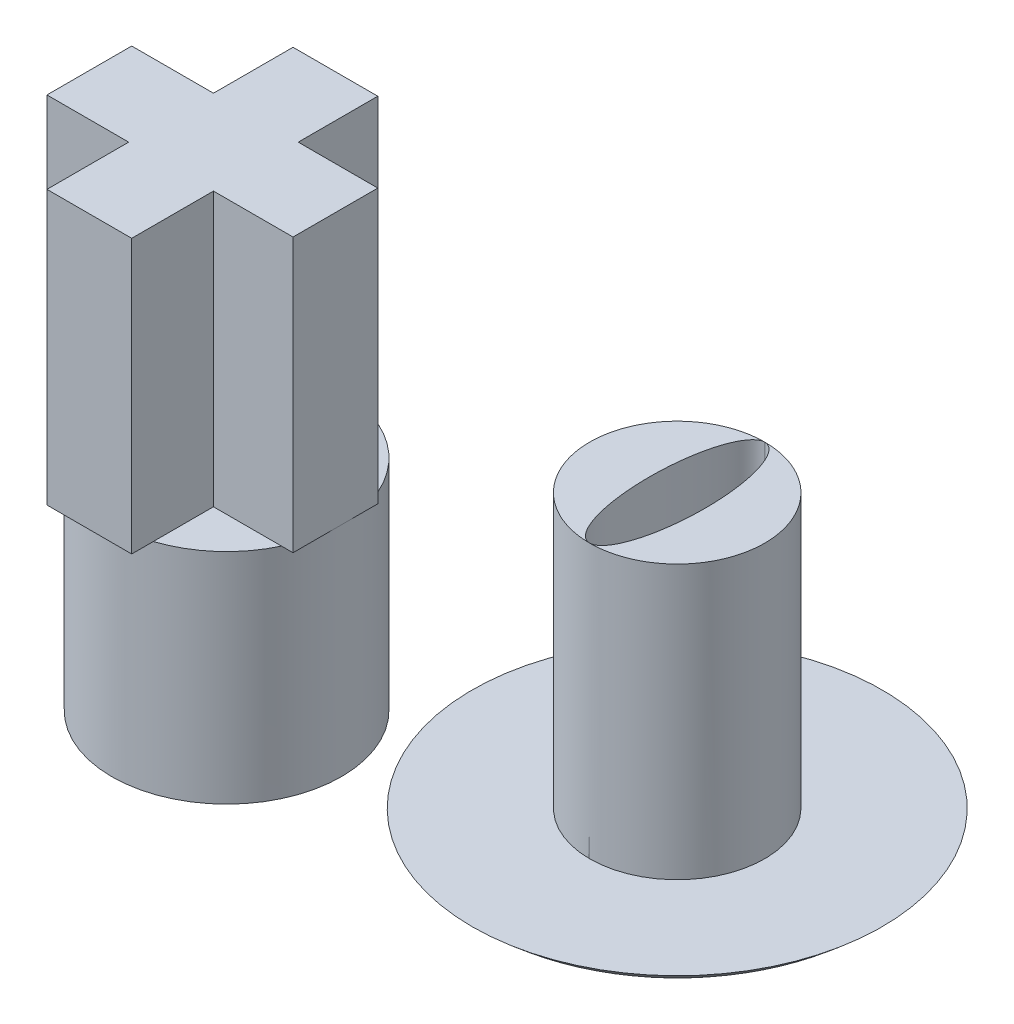
ISO-10303-21;
HEADER;
FILE_DESCRIPTION(('STEP AP214'),'2;1');
FILE_NAME('part.step','',(''),(''),'','','');
FILE_SCHEMA(('AUTOMOTIVE_DESIGN { 1 0 10303 214 1 1 1 1 }'));
ENDSEC;
DATA;
#1=APPLICATION_CONTEXT('core data for automotive mechanical design processes');
#2=APPLICATION_PROTOCOL_DEFINITION('international standard','automotive_design',2000,#1);
#3=PRODUCT_CONTEXT('',#1,'mechanical');
#4=PRODUCT('Part','Part','',(#3));
#5=PRODUCT_RELATED_PRODUCT_CATEGORY('part','',(#4));
#6=PRODUCT_DEFINITION_FORMATION('','',#4);
#7=PRODUCT_DEFINITION_CONTEXT('part definition',#1,'design');
#8=PRODUCT_DEFINITION('design','',#6,#7);
#9=PRODUCT_DEFINITION_SHAPE('','',#8);
#10=(LENGTH_UNIT() NAMED_UNIT(*) SI_UNIT(.MILLI.,.METRE.));
#11=(NAMED_UNIT(*) PLANE_ANGLE_UNIT() SI_UNIT($,.RADIAN.));
#12=(NAMED_UNIT(*) SI_UNIT($,.STERADIAN.) SOLID_ANGLE_UNIT());
#13=UNCERTAINTY_MEASURE_WITH_UNIT(LENGTH_MEASURE(1.E-05),#10,'distance_accuracy_value','');
#14=(GEOMETRIC_REPRESENTATION_CONTEXT(3) GLOBAL_UNCERTAINTY_ASSIGNED_CONTEXT((#13)) GLOBAL_UNIT_ASSIGNED_CONTEXT((#10,
#11,#12)) REPRESENTATION_CONTEXT('',''));
#15=CARTESIAN_POINT('',(0.,0.,0.));
#16=DIRECTION('',(0.,0.,1.));
#17=DIRECTION('',(1.,0.,0.));
#18=AXIS2_PLACEMENT_3D('',#15,#16,#17);
#19=CARTESIAN_POINT('',(6.68090224938002,1.01039824502667,-1.55928841292375));
#20=DIRECTION('',(0.,1.,0.));
#21=DIRECTION('',(0.,0.,1.));
#22=AXIS2_PLACEMENT_3D('',#19,#20,#21);
#23=PLANE('',#22);
#24=CARTESIAN_POINT('',(6.68090224938002,1.01039824502667,-1.55928841292375));
#25=DIRECTION('',(0.,1.,0.));
#26=DIRECTION('',(0.,0.,1.));
#27=AXIS2_PLACEMENT_3D('',#24,#25,#26);
#28=CIRCLE('',#27,1.6);
#29=CARTESIAN_POINT('',(6.68090224938002,1.01039824502667,0.0407115870762478));
#30=VERTEX_POINT('',#29);
#31=EDGE_CURVE('P0_E29',#30,#30,#28,.T.);
#32=ORIENTED_EDGE('',*,*,#31,.F.);
#33=EDGE_LOOP('',(#32));
#34=FACE_BOUND('',#33,.T.);
#35=CARTESIAN_POINT('',(6.68090224938002,1.01039824502667,-1.55928841292375));
#36=DIRECTION('',(0.,1.,0.));
#37=DIRECTION('',(0.,0.,1.));
#38=AXIS2_PLACEMENT_3D('',#35,#36,#37);
#39=CIRCLE('',#38,3.75);
#40=CARTESIAN_POINT('',(6.68090224938002,1.01039824502667,2.19071158707625));
#41=VERTEX_POINT('',#40);
#42=EDGE_CURVE('P0_E21',#41,#41,#39,.T.);
#43=ORIENTED_EDGE('',*,*,#42,.T.);
#44=EDGE_LOOP('',(#43));
#45=FACE_BOUND('',#44,.T.);
#46=ADVANCED_FACE('P0_F14',(#34,#45),#23,.T.);
#47=CARTESIAN_POINT('',(6.68090224938002,0.0103982450266698,-1.55928841292375));
#48=DIRECTION('',(0.,1.,0.));
#49=DIRECTION('',(0.,0.,1.));
#50=AXIS2_PLACEMENT_3D('',#47,#48,#49);
#51=PLANE('',#50);
#52=CARTESIAN_POINT('',(6.68090224938002,0.0103982450266698,-1.55928841292375));
#53=DIRECTION('',(0.,1.,0.));
#54=DIRECTION('',(0.,0.,1.));
#55=AXIS2_PLACEMENT_3D('',#52,#53,#54);
#56=CIRCLE('',#55,1.20049024320361);
#57=CARTESIAN_POINT('',(6.68090224938002,0.0103982450266698,-0.358798169720145));
#58=VERTEX_POINT('',#57);
#59=EDGE_CURVE('P0_E9',#58,#58,#56,.F.);
#60=ORIENTED_EDGE('',*,*,#59,.T.);
#61=EDGE_LOOP('',(#60));
#62=FACE_BOUND('',#61,.T.);
#63=ADVANCED_FACE('P0_F56',(#62),#51,.F.);
#64=CARTESIAN_POINT('',(6.68090224938002,3.76039824502667,-1.55928841292375));
#65=DIRECTION('',(0.,-1.,0.));
#66=DIRECTION('',(0.,0.,-1.));
#67=AXIS2_PLACEMENT_3D('',#64,#65,#66);
#68=DEGENERATE_TOROIDAL_SURFACE('',#67,1.20049024320361,3.75,.T.);
#69=ORIENTED_EDGE('',*,*,#59,.F.);
#70=EDGE_LOOP('',(#69));
#71=FACE_BOUND('',#70,.T.);
#72=ORIENTED_EDGE('',*,*,#42,.F.);
#73=EDGE_LOOP('',(#72));
#74=FACE_BOUND('',#73,.T.);
#75=ADVANCED_FACE('P0_F16',(#71,#74),#68,.T.);
#76=CARTESIAN_POINT('',(6.68090224938002,6.01039824502667,-1.55928841292375));
#77=DIRECTION('',(0.,-1.,0.));
#78=DIRECTION('',(0.,0.,-1.));
#79=AXIS2_PLACEMENT_3D('',#76,#77,#78);
#80=CYLINDRICAL_SURFACE('',#79,1.6);
#81=CARTESIAN_POINT('',(6.68090224938002,6.01039824502667,-1.55928841292375));
#82=DIRECTION('',(0.,1.,0.));
#83=DIRECTION('',(0.,0.,1.));
#84=AXIS2_PLACEMENT_3D('',#81,#82,#83);
#85=CIRCLE('',#84,1.6);
#86=CARTESIAN_POINT('',(6.68090224938002,6.01039824502667,0.0407115870762478));
#87=VERTEX_POINT('',#86);
#88=EDGE_CURVE('P0_E25',#87,#87,#85,.T.);
#89=ORIENTED_EDGE('',*,*,#88,.F.);
#90=EDGE_LOOP('',(#89));
#91=FACE_BOUND('',#90,.T.);
#92=ORIENTED_EDGE('',*,*,#31,.T.);
#93=EDGE_LOOP('',(#92));
#94=FACE_BOUND('',#93,.T.);
#95=ADVANCED_FACE('P0_F50',(#91,#94),#80,.T.);
#96=CARTESIAN_POINT('',(6.68090224938002,6.01039824502667,-1.55928841292375));
#97=DIRECTION('',(0.,1.,0.));
#98=DIRECTION('',(0.,0.,1.));
#99=AXIS2_PLACEMENT_3D('',#96,#97,#98);
#100=PLANE('',#99);
#101=CARTESIAN_POINT('',(6.68090224938002,6.01039824502667,-1.55928841292375));
#102=DIRECTION('',(0.,1.,0.));
#103=DIRECTION('',(-0.000982907133391704,0.,0.999999516946667));
#104=AXIS2_PLACEMENT_3D('',#101,#102,#103);
#105=ELLIPSE('',#104,1.59991667513477,0.502892673821975);
#106=CARTESIAN_POINT('',(6.6793296798672,6.01039824502667,0.0406274893659398));
#107=VERTEX_POINT('',#106);
#108=EDGE_CURVE('P0_E35',#107,#107,#105,.T.);
#109=ORIENTED_EDGE('',*,*,#108,.F.);
#110=EDGE_LOOP('',(#109));
#111=FACE_BOUND('',#110,.T.);
#112=ORIENTED_EDGE('',*,*,#88,.T.);
#113=EDGE_LOOP('',(#112));
#114=FACE_BOUND('',#113,.T.);
#115=ADVANCED_FACE('P0_F46',(#111,#114),#100,.T.);
#116=CARTESIAN_POINT('',(6.68090224938002,1.01039824502667,-1.55928841292375));
#117=DIRECTION('',(0.,1.,0.));
#118=DIRECTION('',(-0.000982907133391704,0.,0.999999516946667));
#119=AXIS2_PLACEMENT_3D('',#116,#117,#118);
#120=ELLIPSE('',#119,1.59991667513477,0.502892673821975);
#121=DIRECTION('',(0.,1.,0.));
#122=VECTOR('',#121,1.);
#123=SURFACE_OF_LINEAR_EXTRUSION('',#120,#122);
#124=CARTESIAN_POINT('',(6.6793296798672,1.01039824502667,0.0406274893659398));
#125=VERTEX_POINT('',#124);
#126=EDGE_CURVE('P0_E33',#125,#125,#120,.T.);
#127=ORIENTED_EDGE('',*,*,#126,.F.);
#128=EDGE_LOOP('',(#127));
#129=FACE_BOUND('',#128,.T.);
#130=ORIENTED_EDGE('',*,*,#108,.T.);
#131=EDGE_LOOP('',(#130));
#132=FACE_BOUND('',#131,.T.);
#133=ADVANCED_FACE('P0_F41',(#129,#132),#123,.F.);
#134=CARTESIAN_POINT('',(6.68090224938002,1.01039824502667,-1.55928841292375));
#135=DIRECTION('',(0.,1.,0.));
#136=DIRECTION('',(0.,0.,1.));
#137=AXIS2_PLACEMENT_3D('',#134,#135,#136);
#138=PLANE('',#137);
#139=ORIENTED_EDGE('',*,*,#126,.T.);
#140=EDGE_LOOP('',(#139));
#141=FACE_BOUND('',#140,.T.);
#142=ADVANCED_FACE('P0_F45',(#141),#138,.T.);
#143=CLOSED_SHELL('',(#46,#63,#75,#95,#115,#133,#142));
#144=MANIFOLD_SOLID_BREP('P0_B1',#143);
#145=CARTESIAN_POINT('',(0.,4.,0.));
#146=DIRECTION('',(0.,1.,0.));
#147=DIRECTION('',(0.,0.,1.));
#148=AXIS2_PLACEMENT_3D('',#145,#146,#147);
#149=PLANE('',#148);
#150=DIRECTION('',(0.,0.,-1.));
#151=VECTOR('',#150,1.);
#152=CARTESIAN_POINT('',(0.655,4.,-0.655));
#153=LINE('',#152,#151);
#154=CARTESIAN_POINT('',(0.655,4.,-0.655));
#155=VERTEX_POINT('',#154);
#156=CARTESIAN_POINT('',(0.655,4.,-1.99523808103194));
#157=VERTEX_POINT('',#156);
#158=EDGE_CURVE('P1_E35',#155,#157,#153,.T.);
#159=ORIENTED_EDGE('',*,*,#158,.F.);
#160=DIRECTION('',(-1.,0.,0.));
#161=VECTOR('',#160,1.);
#162=CARTESIAN_POINT('',(2.11,4.,-0.655));
#163=LINE('',#162,#161);
#164=CARTESIAN_POINT('',(1.99523808103194,4.,-0.655));
#165=VERTEX_POINT('',#164);
#166=EDGE_CURVE('P1_E11',#165,#155,#163,.T.);
#167=ORIENTED_EDGE('',*,*,#166,.F.);
#168=CARTESIAN_POINT('',(0.,4.,0.));
#169=DIRECTION('',(0.,1.,0.));
#170=DIRECTION('',(0.,0.,1.));
#171=AXIS2_PLACEMENT_3D('',#168,#169,#170);
#172=CIRCLE('',#171,2.1);
#173=EDGE_CURVE('P1_E179',#165,#157,#172,.T.);
#174=ORIENTED_EDGE('',*,*,#173,.T.);
#175=EDGE_LOOP('',(#159,#167,#174));
#176=FACE_BOUND('',#175,.T.);
#177=ADVANCED_FACE('P1_F17',(#176),#149,.T.);
#178=DIRECTION('',(1.,0.,0.));
#179=VECTOR('',#178,1.);
#180=CARTESIAN_POINT('',(2.11,4.,0.895));
#181=LINE('',#180,#179);
#182=CARTESIAN_POINT('',(0.655,4.,0.895));
#183=VERTEX_POINT('',#182);
#184=CARTESIAN_POINT('',(1.89973024400834,4.,0.895));
#185=VERTEX_POINT('',#184);
#186=EDGE_CURVE('P1_E42',#183,#185,#181,.T.);
#187=ORIENTED_EDGE('',*,*,#186,.F.);
#188=DIRECTION('',(0.,0.,-1.));
#189=VECTOR('',#188,1.);
#190=CARTESIAN_POINT('',(0.655,4.,2.39));
#191=LINE('',#190,#189);
#192=CARTESIAN_POINT('',(0.655,4.,1.99523808103194));
#193=VERTEX_POINT('',#192);
#194=EDGE_CURVE('P1_E26',#193,#183,#191,.T.);
#195=ORIENTED_EDGE('',*,*,#194,.F.);
#196=EDGE_CURVE('P1_E170',#193,#185,#172,.T.);
#197=ORIENTED_EDGE('',*,*,#196,.T.);
#198=EDGE_LOOP('',(#187,#195,#197));
#199=FACE_BOUND('',#198,.T.);
#200=ADVANCED_FACE('P1_F210',(#199),#149,.T.);
#201=DIRECTION('',(0.,0.,1.));
#202=VECTOR('',#201,1.);
#203=CARTESIAN_POINT('',(-0.895,4.,2.39));
#204=LINE('',#203,#202);
#205=CARTESIAN_POINT('',(-0.895,4.,0.895));
#206=VERTEX_POINT('',#205);
#207=CARTESIAN_POINT('',(-0.895,4.,1.89973024400834));
#208=VERTEX_POINT('',#207);
#209=EDGE_CURVE('P1_E433',#206,#208,#204,.T.);
#210=ORIENTED_EDGE('',*,*,#209,.F.);
#211=DIRECTION('',(1.,0.,0.));
#212=VECTOR('',#211,1.);
#213=CARTESIAN_POINT('',(-0.895,4.,0.895));
#214=LINE('',#213,#212);
#215=CARTESIAN_POINT('',(-1.89973024400834,4.,0.895));
#216=VERTEX_POINT('',#215);
#217=EDGE_CURVE('P1_E175',#216,#206,#214,.T.);
#218=ORIENTED_EDGE('',*,*,#217,.F.);
#219=EDGE_CURVE('P1_E181',#216,#208,#172,.T.);
#220=ORIENTED_EDGE('',*,*,#219,.T.);
#221=EDGE_LOOP('',(#210,#218,#220));
#222=FACE_BOUND('',#221,.T.);
#223=ADVANCED_FACE('P1_F207',(#222),#149,.T.);
#224=CARTESIAN_POINT('',(0.,4.,0.));
#225=DIRECTION('',(0.,-1.,0.));
#226=DIRECTION('',(0.,0.,-1.));
#227=AXIS2_PLACEMENT_3D('',#224,#225,#226);
#228=CYLINDRICAL_SURFACE('',#227,2.1);
#229=ORIENTED_EDGE('',*,*,#196,.F.);
#230=EDGE_CURVE('P1_E172',#208,#193,#172,.T.);
#231=ORIENTED_EDGE('',*,*,#230,.F.);
#232=ORIENTED_EDGE('',*,*,#219,.F.);
#233=CARTESIAN_POINT('',(-1.99523808103194,4.,-0.655));
#234=VERTEX_POINT('',#233);
#235=EDGE_CURVE('P1_E187',#234,#216,#172,.T.);
#236=ORIENTED_EDGE('',*,*,#235,.F.);
#237=CARTESIAN_POINT('',(-0.895,4.,-1.89973024400834));
#238=VERTEX_POINT('',#237);
#239=EDGE_CURVE('P1_E514',#238,#234,#172,.T.);
#240=ORIENTED_EDGE('',*,*,#239,.F.);
#241=EDGE_CURVE('P1_E515',#157,#238,#172,.T.);
#242=ORIENTED_EDGE('',*,*,#241,.F.);
#243=ORIENTED_EDGE('',*,*,#173,.F.);
#244=EDGE_CURVE('P1_E171',#185,#165,#172,.T.);
#245=ORIENTED_EDGE('',*,*,#244,.F.);
#246=EDGE_LOOP('',(#229,#231,#232,#236,#240,#242,#243,#245));
#247=FACE_BOUND('',#246,.T.);
#248=CARTESIAN_POINT('',(0.,0.,0.));
#249=DIRECTION('',(0.,1.,0.));
#250=DIRECTION('',(0.,0.,1.));
#251=AXIS2_PLACEMENT_3D('',#248,#249,#250);
#252=CIRCLE('',#251,2.1);
#253=CARTESIAN_POINT('',(0.,0.,2.1));
#254=VERTEX_POINT('',#253);
#255=EDGE_CURVE('P1_E21',#254,#254,#252,.T.);
#256=ORIENTED_EDGE('',*,*,#255,.T.);
#257=EDGE_LOOP('',(#256));
#258=FACE_BOUND('',#257,.T.);
#259=ADVANCED_FACE('P1_F19',(#247,#258),#228,.T.);
#260=DIRECTION('',(0.,0.,1.));
#261=VECTOR('',#260,1.);
#262=CARTESIAN_POINT('',(-0.895,4.,-0.655));
#263=LINE('',#262,#261);
#264=CARTESIAN_POINT('',(-0.895,4.,-0.655));
#265=VERTEX_POINT('',#264);
#266=EDGE_CURVE('P1_E159',#238,#265,#263,.T.);
#267=ORIENTED_EDGE('',*,*,#266,.F.);
#268=ORIENTED_EDGE('',*,*,#239,.T.);
#269=DIRECTION('',(-1.,0.,0.));
#270=VECTOR('',#269,1.);
#271=CARTESIAN_POINT('',(-0.895,4.,-0.655));
#272=LINE('',#271,#270);
#273=EDGE_CURVE('P1_E489',#265,#234,#272,.T.);
#274=ORIENTED_EDGE('',*,*,#273,.F.);
#275=EDGE_LOOP('',(#267,#268,#274));
#276=FACE_BOUND('',#275,.T.);
#277=ADVANCED_FACE('P1_F195',(#276),#149,.T.);
#278=CARTESIAN_POINT('',(0.,0.,0.));
#279=DIRECTION('',(0.,1.,0.));
#280=DIRECTION('',(0.,0.,1.));
#281=AXIS2_PLACEMENT_3D('',#278,#279,#280);
#282=PLANE('',#281);
#283=CARTESIAN_POINT('',(0.,0.,0.));
#284=DIRECTION('',(0.,-1.,0.));
#285=DIRECTION('',(0.,0.,-1.));
#286=AXIS2_PLACEMENT_3D('',#283,#284,#285);
#287=CIRCLE('',#286,1.6);
#288=CARTESIAN_POINT('',(0.,0.,-1.6));
#289=VERTEX_POINT('',#288);
#290=EDGE_CURVE('P1_E160',#289,#289,#287,.T.);
#291=ORIENTED_EDGE('',*,*,#290,.F.);
#292=EDGE_LOOP('',(#291));
#293=FACE_BOUND('',#292,.T.);
#294=ORIENTED_EDGE('',*,*,#255,.F.);
#295=EDGE_LOOP('',(#294));
#296=FACE_BOUND('',#295,.T.);
#297=ADVANCED_FACE('P1_F192',(#293,#296),#282,.F.);
#298=CARTESIAN_POINT('',(0.,3.,0.));
#299=DIRECTION('',(0.,-1.,0.));
#300=DIRECTION('',(0.,0.,-1.));
#301=AXIS2_PLACEMENT_3D('',#298,#299,#300);
#302=CYLINDRICAL_SURFACE('',#301,1.6);
#303=CARTESIAN_POINT('',(0.,3.,0.));
#304=DIRECTION('',(0.,-1.,0.));
#305=DIRECTION('',(0.,0.,-1.));
#306=AXIS2_PLACEMENT_3D('',#303,#304,#305);
#307=CIRCLE('',#306,1.6);
#308=CARTESIAN_POINT('',(0.,3.,-1.6));
#309=VERTEX_POINT('',#308);
#310=EDGE_CURVE('P1_E163',#309,#309,#307,.T.);
#311=ORIENTED_EDGE('',*,*,#310,.F.);
#312=EDGE_LOOP('',(#311));
#313=FACE_BOUND('',#312,.T.);
#314=ORIENTED_EDGE('',*,*,#290,.T.);
#315=EDGE_LOOP('',(#314));
#316=FACE_BOUND('',#315,.T.);
#317=ADVANCED_FACE('P1_F194',(#313,#316),#302,.F.);
#318=CARTESIAN_POINT('',(0.,3.,0.));
#319=DIRECTION('',(0.,-1.,0.));
#320=DIRECTION('',(0.,0.,-1.));
#321=AXIS2_PLACEMENT_3D('',#318,#319,#320);
#322=PLANE('',#321);
#323=ORIENTED_EDGE('',*,*,#310,.T.);
#324=EDGE_LOOP('',(#323));
#325=FACE_BOUND('',#324,.T.);
#326=ADVANCED_FACE('P1_F202',(#325),#322,.T.);
#327=CARTESIAN_POINT('',(0.,4.,0.));
#328=DIRECTION('',(0.,1.,0.));
#329=DIRECTION('',(0.,0.,1.));
#330=AXIS2_PLACEMENT_3D('',#327,#328,#329);
#331=PLANE('',#330);
#332=CARTESIAN_POINT('',(2.11,4.,0.895));
#333=VERTEX_POINT('',#332);
#334=EDGE_CURVE('P1_E483',#185,#333,#181,.T.);
#335=ORIENTED_EDGE('',*,*,#334,.F.);
#336=ORIENTED_EDGE('',*,*,#244,.T.);
#337=CARTESIAN_POINT('',(2.11,4.,-0.655));
#338=VERTEX_POINT('',#337);
#339=EDGE_CURVE('P1_E28',#338,#165,#163,.T.);
#340=ORIENTED_EDGE('',*,*,#339,.F.);
#341=DIRECTION('',(0.,0.,-1.));
#342=VECTOR('',#341,1.);
#343=CARTESIAN_POINT('',(2.11,4.,0.895));
#344=LINE('',#343,#342);
#345=EDGE_CURVE('P1_E480',#333,#338,#344,.T.);
#346=ORIENTED_EDGE('',*,*,#345,.F.);
#347=EDGE_LOOP('',(#335,#336,#340,#346));
#348=FACE_BOUND('',#347,.T.);
#349=ADVANCED_FACE('P1_F217',(#348),#331,.F.);
#350=CARTESIAN_POINT('',(0.655,4.,-2.11));
#351=VERTEX_POINT('',#350);
#352=EDGE_CURVE('P1_E477',#157,#351,#153,.T.);
#353=ORIENTED_EDGE('',*,*,#352,.F.);
#354=ORIENTED_EDGE('',*,*,#241,.T.);
#355=CARTESIAN_POINT('',(-0.895,4.,-2.11));
#356=VERTEX_POINT('',#355);
#357=EDGE_CURVE('P1_E177',#356,#238,#263,.T.);
#358=ORIENTED_EDGE('',*,*,#357,.F.);
#359=DIRECTION('',(-1.,0.,0.));
#360=VECTOR('',#359,1.);
#361=CARTESIAN_POINT('',(0.655,4.,-2.11));
#362=LINE('',#361,#360);
#363=EDGE_CURVE('P1_E154',#351,#356,#362,.T.);
#364=ORIENTED_EDGE('',*,*,#363,.F.);
#365=EDGE_LOOP('',(#353,#354,#358,#364));
#366=FACE_BOUND('',#365,.T.);
#367=ADVANCED_FACE('P1_F266',(#366),#331,.F.);
#368=CARTESIAN_POINT('',(-2.39,4.,-0.655));
#369=VERTEX_POINT('',#368);
#370=EDGE_CURVE('P1_E490',#234,#369,#272,.T.);
#371=ORIENTED_EDGE('',*,*,#370,.F.);
#372=ORIENTED_EDGE('',*,*,#235,.T.);
#373=CARTESIAN_POINT('',(-2.39,4.,0.895));
#374=VERTEX_POINT('',#373);
#375=EDGE_CURVE('P1_E447',#374,#216,#214,.T.);
#376=ORIENTED_EDGE('',*,*,#375,.F.);
#377=DIRECTION('',(0.,0.,1.));
#378=VECTOR('',#377,1.);
#379=CARTESIAN_POINT('',(-2.39,4.,0.895));
#380=LINE('',#379,#378);
#381=EDGE_CURVE('P1_E487',#369,#374,#380,.T.);
#382=ORIENTED_EDGE('',*,*,#381,.F.);
#383=EDGE_LOOP('',(#371,#372,#376,#382));
#384=FACE_BOUND('',#383,.T.);
#385=ADVANCED_FACE('P1_F340',(#384),#331,.F.);
#386=CARTESIAN_POINT('',(-0.895,4.,2.39));
#387=VERTEX_POINT('',#386);
#388=EDGE_CURVE('P1_E438',#208,#387,#204,.T.);
#389=ORIENTED_EDGE('',*,*,#388,.F.);
#390=ORIENTED_EDGE('',*,*,#230,.T.);
#391=CARTESIAN_POINT('',(0.655,4.,2.39));
#392=VERTEX_POINT('',#391);
#393=EDGE_CURVE('P1_E484',#392,#193,#191,.T.);
#394=ORIENTED_EDGE('',*,*,#393,.F.);
#395=DIRECTION('',(1.,0.,0.));
#396=VECTOR('',#395,1.);
#397=CARTESIAN_POINT('',(0.655,4.,2.39));
#398=LINE('',#397,#396);
#399=EDGE_CURVE('P1_E437',#387,#392,#398,.T.);
#400=ORIENTED_EDGE('',*,*,#399,.F.);
#401=EDGE_LOOP('',(#389,#390,#394,#400));
#402=FACE_BOUND('',#401,.T.);
#403=ADVANCED_FACE('P1_F221',(#402),#331,.F.);
#404=CARTESIAN_POINT('',(-0.895,9.,-0.655));
#405=DIRECTION('',(1.,0.,0.));
#406=DIRECTION('',(0.,0.,-1.));
#407=AXIS2_PLACEMENT_3D('',#404,#405,#406);
#408=PLANE('',#407);
#409=ORIENTED_EDGE('',*,*,#357,.T.);
#410=ORIENTED_EDGE('',*,*,#266,.T.);
#411=DIRECTION('',(0.,-1.,0.));
#412=VECTOR('',#411,1.);
#413=CARTESIAN_POINT('',(-0.895,9.,-0.655));
#414=LINE('',#413,#412);
#415=CARTESIAN_POINT('',(-0.895,9.,-0.655));
#416=VERTEX_POINT('',#415);
#417=EDGE_CURVE('P1_E139',#416,#265,#414,.T.);
#418=ORIENTED_EDGE('',*,*,#417,.F.);
#419=DIRECTION('',(0.,0.,1.));
#420=VECTOR('',#419,1.);
#421=CARTESIAN_POINT('',(-0.895,9.,-0.655));
#422=LINE('',#421,#420);
#423=CARTESIAN_POINT('',(-0.895,9.,-2.11));
#424=VERTEX_POINT('',#423);
#425=EDGE_CURVE('P1_E145',#424,#416,#422,.T.);
#426=ORIENTED_EDGE('',*,*,#425,.F.);
#427=DIRECTION('',(0.,-1.,0.));
#428=VECTOR('',#427,1.);
#429=CARTESIAN_POINT('',(-0.895,9.,-2.11));
#430=LINE('',#429,#428);
#431=EDGE_CURVE('P1_E474',#424,#356,#430,.T.);
#432=ORIENTED_EDGE('',*,*,#431,.T.);
#433=EDGE_LOOP('',(#409,#410,#418,#426,#432));
#434=FACE_BOUND('',#433,.T.);
#435=ADVANCED_FACE('P1_F158',(#434),#408,.F.);
#436=CARTESIAN_POINT('',(-0.895,9.,-0.655));
#437=DIRECTION('',(0.,0.,1.));
#438=DIRECTION('',(1.,0.,0.));
#439=AXIS2_PLACEMENT_3D('',#436,#437,#438);
#440=PLANE('',#439);
#441=ORIENTED_EDGE('',*,*,#273,.T.);
#442=ORIENTED_EDGE('',*,*,#370,.T.);
#443=DIRECTION('',(0.,-1.,0.));
#444=VECTOR('',#443,1.);
#445=CARTESIAN_POINT('',(-2.39,9.,-0.655));
#446=LINE('',#445,#444);
#447=CARTESIAN_POINT('',(-2.39,9.,-0.655));
#448=VERTEX_POINT('',#447);
#449=EDGE_CURVE('P1_E141',#448,#369,#446,.T.);
#450=ORIENTED_EDGE('',*,*,#449,.F.);
#451=DIRECTION('',(-1.,0.,0.));
#452=VECTOR('',#451,1.);
#453=CARTESIAN_POINT('',(-0.895,9.,-0.655));
#454=LINE('',#453,#452);
#455=EDGE_CURVE('P1_E134',#416,#448,#454,.T.);
#456=ORIENTED_EDGE('',*,*,#455,.F.);
#457=ORIENTED_EDGE('',*,*,#417,.T.);
#458=EDGE_LOOP('',(#441,#442,#450,#456,#457));
#459=FACE_BOUND('',#458,.T.);
#460=ADVANCED_FACE('P1_F137',(#459),#440,.F.);
#461=CARTESIAN_POINT('',(-2.39,9.,0.895));
#462=DIRECTION('',(1.,0.,0.));
#463=DIRECTION('',(0.,0.,-1.));
#464=AXIS2_PLACEMENT_3D('',#461,#462,#463);
#465=PLANE('',#464);
#466=ORIENTED_EDGE('',*,*,#381,.T.);
#467=DIRECTION('',(0.,-1.,0.));
#468=VECTOR('',#467,1.);
#469=CARTESIAN_POINT('',(-2.39,9.,0.895));
#470=LINE('',#469,#468);
#471=CARTESIAN_POINT('',(-2.39,9.,0.895));
#472=VERTEX_POINT('',#471);
#473=EDGE_CURVE('P1_E165',#472,#374,#470,.T.);
#474=ORIENTED_EDGE('',*,*,#473,.F.);
#475=DIRECTION('',(0.,0.,1.));
#476=VECTOR('',#475,1.);
#477=CARTESIAN_POINT('',(-2.39,9.,0.895));
#478=LINE('',#477,#476);
#479=EDGE_CURVE('P1_E144',#448,#472,#478,.T.);
#480=ORIENTED_EDGE('',*,*,#479,.F.);
#481=ORIENTED_EDGE('',*,*,#449,.T.);
#482=EDGE_LOOP('',(#466,#474,#480,#481));
#483=FACE_BOUND('',#482,.T.);
#484=ADVANCED_FACE('P1_F224',(#483),#465,.F.);
#485=CARTESIAN_POINT('',(-0.895,9.,0.895));
#486=DIRECTION('',(0.,0.,-1.));
#487=DIRECTION('',(-1.,0.,0.));
#488=AXIS2_PLACEMENT_3D('',#485,#486,#487);
#489=PLANE('',#488);
#490=ORIENTED_EDGE('',*,*,#375,.T.);
#491=ORIENTED_EDGE('',*,*,#217,.T.);
#492=DIRECTION('',(0.,-1.,0.));
#493=VECTOR('',#492,1.);
#494=CARTESIAN_POINT('',(-0.895,9.,0.895));
#495=LINE('',#494,#493);
#496=CARTESIAN_POINT('',(-0.895,9.,0.895));
#497=VERTEX_POINT('',#496);
#498=EDGE_CURVE('P1_E443',#497,#206,#495,.T.);
#499=ORIENTED_EDGE('',*,*,#498,.F.);
#500=DIRECTION('',(1.,0.,0.));
#501=VECTOR('',#500,1.);
#502=CARTESIAN_POINT('',(-0.895,9.,0.895));
#503=LINE('',#502,#501);
#504=EDGE_CURVE('P1_E506',#472,#497,#503,.T.);
#505=ORIENTED_EDGE('',*,*,#504,.F.);
#506=ORIENTED_EDGE('',*,*,#473,.T.);
#507=EDGE_LOOP('',(#490,#491,#499,#505,#506));
#508=FACE_BOUND('',#507,.T.);
#509=ADVANCED_FACE('P1_F227',(#508),#489,.F.);
#510=CARTESIAN_POINT('',(-0.895,9.,2.39));
#511=DIRECTION('',(1.,0.,0.));
#512=DIRECTION('',(0.,0.,-1.));
#513=AXIS2_PLACEMENT_3D('',#510,#511,#512);
#514=PLANE('',#513);
#515=ORIENTED_EDGE('',*,*,#209,.T.);
#516=ORIENTED_EDGE('',*,*,#388,.T.);
#517=DIRECTION('',(0.,-1.,0.));
#518=VECTOR('',#517,1.);
#519=CARTESIAN_POINT('',(-0.895,9.,2.39));
#520=LINE('',#519,#518);
#521=CARTESIAN_POINT('',(-0.895,9.,2.39));
#522=VERTEX_POINT('',#521);
#523=EDGE_CURVE('P1_E451',#522,#387,#520,.T.);
#524=ORIENTED_EDGE('',*,*,#523,.F.);
#525=DIRECTION('',(0.,0.,1.));
#526=VECTOR('',#525,1.);
#527=CARTESIAN_POINT('',(-0.895,9.,2.39));
#528=LINE('',#527,#526);
#529=EDGE_CURVE('P1_E450',#497,#522,#528,.T.);
#530=ORIENTED_EDGE('',*,*,#529,.F.);
#531=ORIENTED_EDGE('',*,*,#498,.T.);
#532=EDGE_LOOP('',(#515,#516,#524,#530,#531));
#533=FACE_BOUND('',#532,.T.);
#534=ADVANCED_FACE('P1_F231',(#533),#514,.F.);
#535=CARTESIAN_POINT('',(0.655,9.,2.39));
#536=DIRECTION('',(0.,0.,-1.));
#537=DIRECTION('',(-1.,0.,0.));
#538=AXIS2_PLACEMENT_3D('',#535,#536,#537);
#539=PLANE('',#538);
#540=ORIENTED_EDGE('',*,*,#399,.T.);
#541=DIRECTION('',(0.,-1.,0.));
#542=VECTOR('',#541,1.);
#543=CARTESIAN_POINT('',(0.655,9.,2.39));
#544=LINE('',#543,#542);
#545=CARTESIAN_POINT('',(0.655,9.,2.39));
#546=VERTEX_POINT('',#545);
#547=EDGE_CURVE('P1_E454',#546,#392,#544,.T.);
#548=ORIENTED_EDGE('',*,*,#547,.F.);
#549=DIRECTION('',(1.,0.,0.));
#550=VECTOR('',#549,1.);
#551=CARTESIAN_POINT('',(0.655,9.,2.39));
#552=LINE('',#551,#550);
#553=EDGE_CURVE('P1_E503',#522,#546,#552,.T.);
#554=ORIENTED_EDGE('',*,*,#553,.F.);
#555=ORIENTED_EDGE('',*,*,#523,.T.);
#556=EDGE_LOOP('',(#540,#548,#554,#555));
#557=FACE_BOUND('',#556,.T.);
#558=ADVANCED_FACE('P1_F235',(#557),#539,.F.);
#559=CARTESIAN_POINT('',(0.655,9.,2.39));
#560=DIRECTION('',(-1.,0.,0.));
#561=DIRECTION('',(0.,0.,1.));
#562=AXIS2_PLACEMENT_3D('',#559,#560,#561);
#563=PLANE('',#562);
#564=ORIENTED_EDGE('',*,*,#393,.T.);
#565=ORIENTED_EDGE('',*,*,#194,.T.);
#566=DIRECTION('',(0.,-1.,0.));
#567=VECTOR('',#566,1.);
#568=CARTESIAN_POINT('',(0.655,9.,0.895));
#569=LINE('',#568,#567);
#570=CARTESIAN_POINT('',(0.655,9.,0.895));
#571=VERTEX_POINT('',#570);
#572=EDGE_CURVE('P1_E459',#571,#183,#569,.T.);
#573=ORIENTED_EDGE('',*,*,#572,.F.);
#574=DIRECTION('',(0.,0.,-1.));
#575=VECTOR('',#574,1.);
#576=CARTESIAN_POINT('',(0.655,9.,2.39));
#577=LINE('',#576,#575);
#578=EDGE_CURVE('P1_E501',#546,#571,#577,.T.);
#579=ORIENTED_EDGE('',*,*,#578,.F.);
#580=ORIENTED_EDGE('',*,*,#547,.T.);
#581=EDGE_LOOP('',(#564,#565,#573,#579,#580));
#582=FACE_BOUND('',#581,.T.);
#583=ADVANCED_FACE('P1_F239',(#582),#563,.F.);
#584=CARTESIAN_POINT('',(2.11,9.,0.895));
#585=DIRECTION('',(0.,0.,-1.));
#586=DIRECTION('',(-1.,0.,0.));
#587=AXIS2_PLACEMENT_3D('',#584,#585,#586);
#588=PLANE('',#587);
#589=ORIENTED_EDGE('',*,*,#186,.T.);
#590=ORIENTED_EDGE('',*,*,#334,.T.);
#591=DIRECTION('',(0.,-1.,0.));
#592=VECTOR('',#591,1.);
#593=CARTESIAN_POINT('',(2.11,9.,0.895));
#594=LINE('',#593,#592);
#595=CARTESIAN_POINT('',(2.11,9.,0.895));
#596=VERTEX_POINT('',#595);
#597=EDGE_CURVE('P1_E462',#596,#333,#594,.T.);
#598=ORIENTED_EDGE('',*,*,#597,.F.);
#599=DIRECTION('',(1.,0.,0.));
#600=VECTOR('',#599,1.);
#601=CARTESIAN_POINT('',(2.11,9.,0.895));
#602=LINE('',#601,#600);
#603=EDGE_CURVE('P1_E499',#571,#596,#602,.T.);
#604=ORIENTED_EDGE('',*,*,#603,.F.);
#605=ORIENTED_EDGE('',*,*,#572,.T.);
#606=EDGE_LOOP('',(#589,#590,#598,#604,#605));
#607=FACE_BOUND('',#606,.T.);
#608=ADVANCED_FACE('P1_F243',(#607),#588,.F.);
#609=CARTESIAN_POINT('',(2.11,9.,0.895));
#610=DIRECTION('',(-1.,0.,0.));
#611=DIRECTION('',(0.,0.,1.));
#612=AXIS2_PLACEMENT_3D('',#609,#610,#611);
#613=PLANE('',#612);
#614=ORIENTED_EDGE('',*,*,#345,.T.);
#615=DIRECTION('',(0.,-1.,0.));
#616=VECTOR('',#615,1.);
#617=CARTESIAN_POINT('',(2.11,9.,-0.655));
#618=LINE('',#617,#616);
#619=CARTESIAN_POINT('',(2.11,9.,-0.655));
#620=VERTEX_POINT('',#619);
#621=EDGE_CURVE('P1_E465',#620,#338,#618,.T.);
#622=ORIENTED_EDGE('',*,*,#621,.F.);
#623=DIRECTION('',(0.,0.,-1.));
#624=VECTOR('',#623,1.);
#625=CARTESIAN_POINT('',(2.11,9.,0.895));
#626=LINE('',#625,#624);
#627=EDGE_CURVE('P1_E497',#596,#620,#626,.T.);
#628=ORIENTED_EDGE('',*,*,#627,.F.);
#629=ORIENTED_EDGE('',*,*,#597,.T.);
#630=EDGE_LOOP('',(#614,#622,#628,#629));
#631=FACE_BOUND('',#630,.T.);
#632=ADVANCED_FACE('P1_F247',(#631),#613,.F.);
#633=CARTESIAN_POINT('',(2.11,9.,-0.655));
#634=DIRECTION('',(0.,0.,1.));
#635=DIRECTION('',(1.,0.,0.));
#636=AXIS2_PLACEMENT_3D('',#633,#634,#635);
#637=PLANE('',#636);
#638=ORIENTED_EDGE('',*,*,#339,.T.);
#639=ORIENTED_EDGE('',*,*,#166,.T.);
#640=DIRECTION('',(0.,-1.,0.));
#641=VECTOR('',#640,1.);
#642=CARTESIAN_POINT('',(0.655,9.,-0.655));
#643=LINE('',#642,#641);
#644=CARTESIAN_POINT('',(0.655,9.,-0.655));
#645=VERTEX_POINT('',#644);
#646=EDGE_CURVE('P1_E468',#645,#155,#643,.T.);
#647=ORIENTED_EDGE('',*,*,#646,.F.);
#648=DIRECTION('',(-1.,0.,0.));
#649=VECTOR('',#648,1.);
#650=CARTESIAN_POINT('',(2.11,9.,-0.655));
#651=LINE('',#650,#649);
#652=EDGE_CURVE('P1_E495',#620,#645,#651,.T.);
#653=ORIENTED_EDGE('',*,*,#652,.F.);
#654=ORIENTED_EDGE('',*,*,#621,.T.);
#655=EDGE_LOOP('',(#638,#639,#647,#653,#654));
#656=FACE_BOUND('',#655,.T.);
#657=ADVANCED_FACE('P1_F251',(#656),#637,.F.);
#658=CARTESIAN_POINT('',(0.655,9.,-0.655));
#659=DIRECTION('',(-1.,0.,0.));
#660=DIRECTION('',(0.,0.,1.));
#661=AXIS2_PLACEMENT_3D('',#658,#659,#660);
#662=PLANE('',#661);
#663=ORIENTED_EDGE('',*,*,#158,.T.);
#664=ORIENTED_EDGE('',*,*,#352,.T.);
#665=DIRECTION('',(0.,-1.,0.));
#666=VECTOR('',#665,1.);
#667=CARTESIAN_POINT('',(0.655,9.,-2.11));
#668=LINE('',#667,#666);
#669=CARTESIAN_POINT('',(0.655,9.,-2.11));
#670=VERTEX_POINT('',#669);
#671=EDGE_CURVE('P1_E471',#670,#351,#668,.T.);
#672=ORIENTED_EDGE('',*,*,#671,.F.);
#673=DIRECTION('',(0.,0.,-1.));
#674=VECTOR('',#673,1.);
#675=CARTESIAN_POINT('',(0.655,9.,-0.655));
#676=LINE('',#675,#674);
#677=EDGE_CURVE('P1_E493',#645,#670,#676,.T.);
#678=ORIENTED_EDGE('',*,*,#677,.F.);
#679=ORIENTED_EDGE('',*,*,#646,.T.);
#680=EDGE_LOOP('',(#663,#664,#672,#678,#679));
#681=FACE_BOUND('',#680,.T.);
#682=ADVANCED_FACE('P1_F255',(#681),#662,.F.);
#683=CARTESIAN_POINT('',(0.655,9.,-2.11));
#684=DIRECTION('',(0.,0.,1.));
#685=DIRECTION('',(1.,0.,0.));
#686=AXIS2_PLACEMENT_3D('',#683,#684,#685);
#687=PLANE('',#686);
#688=ORIENTED_EDGE('',*,*,#363,.T.);
#689=ORIENTED_EDGE('',*,*,#431,.F.);
#690=DIRECTION('',(-1.,0.,0.));
#691=VECTOR('',#690,1.);
#692=CARTESIAN_POINT('',(0.655,9.,-2.11));
#693=LINE('',#692,#691);
#694=EDGE_CURVE('P1_E150',#670,#424,#693,.T.);
#695=ORIENTED_EDGE('',*,*,#694,.F.);
#696=ORIENTED_EDGE('',*,*,#671,.T.);
#697=EDGE_LOOP('',(#688,#689,#695,#696));
#698=FACE_BOUND('',#697,.T.);
#699=ADVANCED_FACE('P1_F259',(#698),#687,.F.);
#700=CARTESIAN_POINT('',(0.,9.,0.));
#701=DIRECTION('',(0.,1.,0.));
#702=DIRECTION('',(0.,0.,1.));
#703=AXIS2_PLACEMENT_3D('',#700,#701,#702);
#704=PLANE('',#703);
#705=ORIENTED_EDGE('',*,*,#425,.T.);
#706=ORIENTED_EDGE('',*,*,#455,.T.);
#707=ORIENTED_EDGE('',*,*,#479,.T.);
#708=ORIENTED_EDGE('',*,*,#504,.T.);
#709=ORIENTED_EDGE('',*,*,#529,.T.);
#710=ORIENTED_EDGE('',*,*,#553,.T.);
#711=ORIENTED_EDGE('',*,*,#578,.T.);
#712=ORIENTED_EDGE('',*,*,#603,.T.);
#713=ORIENTED_EDGE('',*,*,#627,.T.);
#714=ORIENTED_EDGE('',*,*,#652,.T.);
#715=ORIENTED_EDGE('',*,*,#677,.T.);
#716=ORIENTED_EDGE('',*,*,#694,.T.);
#717=EDGE_LOOP('',(#705,#706,#707,#708,#709,#710,#711,#712,#713,#714,#715,#716));
#718=FACE_BOUND('',#717,.T.);
#719=ADVANCED_FACE('P1_F148',(#718),#704,.T.);
#720=CLOSED_SHELL('',(#177,#200,#223,#259,#277,#297,#317,#326,#349,#367,#385,#403,#435,#460,
#484,#509,#534,#558,#583,#608,#632,#657,#682,#699,#719));
#721=MANIFOLD_SOLID_BREP('P1_B1',#720);
#722=ADVANCED_BREP_SHAPE_REPRESENTATION('',(#18,#144,#721),#14);
#723=SHAPE_DEFINITION_REPRESENTATION(#9,#722);
ENDSEC;
END-ISO-10303-21;
